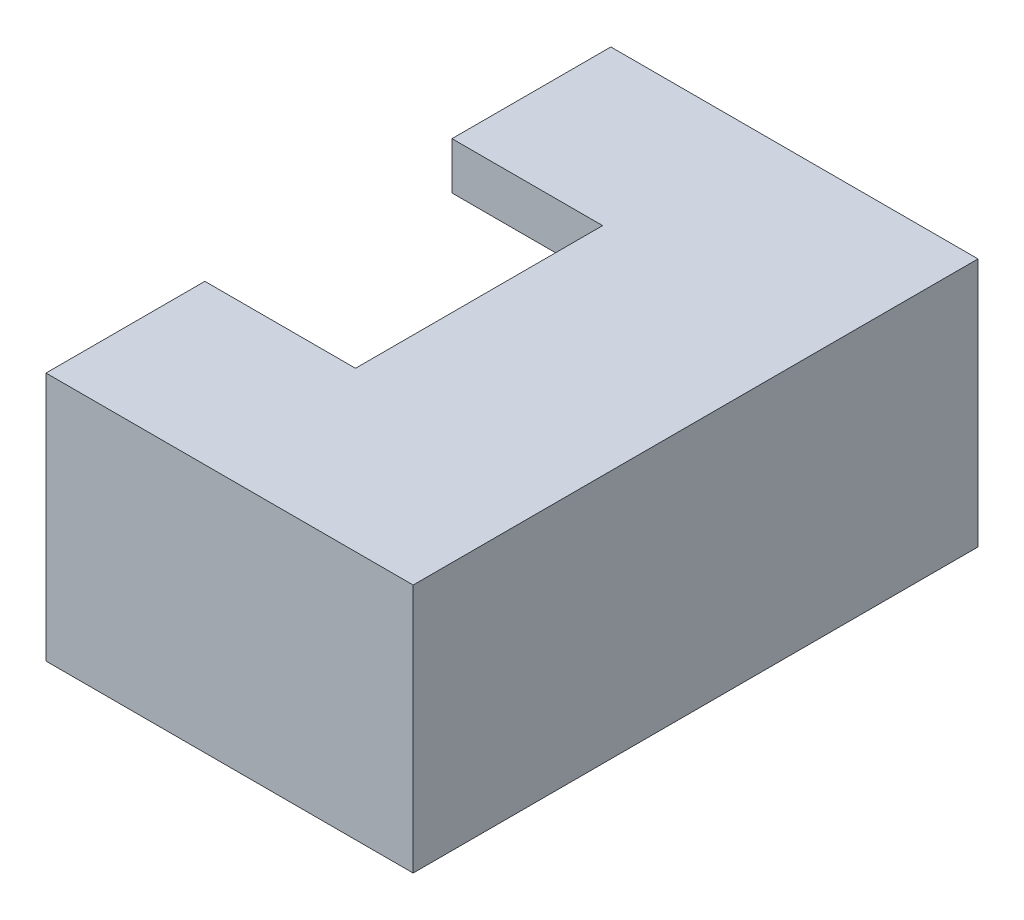
ISO-10303-21;
HEADER;
FILE_DESCRIPTION(('STEP AP214'),'2;1');
FILE_NAME('part.step','',(''),(''),'','','');
FILE_SCHEMA(('AUTOMOTIVE_DESIGN { 1 0 10303 214 1 1 1 1 }'));
ENDSEC;
DATA;
#1=APPLICATION_CONTEXT('core data for automotive mechanical design processes');
#2=APPLICATION_PROTOCOL_DEFINITION('international standard','automotive_design',2000,#1);
#3=PRODUCT_CONTEXT('',#1,'mechanical');
#4=PRODUCT('Part','Part','',(#3));
#5=PRODUCT_RELATED_PRODUCT_CATEGORY('part','',(#4));
#6=PRODUCT_DEFINITION_FORMATION('','',#4);
#7=PRODUCT_DEFINITION_CONTEXT('part definition',#1,'design');
#8=PRODUCT_DEFINITION('design','',#6,#7);
#9=PRODUCT_DEFINITION_SHAPE('','',#8);
#10=(LENGTH_UNIT() NAMED_UNIT(*) SI_UNIT(.MILLI.,.METRE.));
#11=(NAMED_UNIT(*) PLANE_ANGLE_UNIT() SI_UNIT($,.RADIAN.));
#12=(NAMED_UNIT(*) SI_UNIT($,.STERADIAN.) SOLID_ANGLE_UNIT());
#13=UNCERTAINTY_MEASURE_WITH_UNIT(LENGTH_MEASURE(1.E-05),#10,'distance_accuracy_value','');
#14=(GEOMETRIC_REPRESENTATION_CONTEXT(3) GLOBAL_UNCERTAINTY_ASSIGNED_CONTEXT((#13)) GLOBAL_UNIT_ASSIGNED_CONTEXT((#10,
#11,#12)) REPRESENTATION_CONTEXT('',''));
#15=CARTESIAN_POINT('',(0.,0.,0.));
#16=DIRECTION('',(0.,0.,1.));
#17=DIRECTION('',(1.,0.,0.));
#18=AXIS2_PLACEMENT_3D('',#15,#16,#17);
#19=CARTESIAN_POINT('',(7.55,3.4,-3.3));
#20=DIRECTION('',(1.,0.,0.));
#21=DIRECTION('',(0.,0.,-1.));
#22=AXIS2_PLACEMENT_3D('',#19,#20,#21);
#23=PLANE('',#22);
#24=DIRECTION('',(0.,-1.,0.));
#25=VECTOR('',#24,1.);
#26=CARTESIAN_POINT('',(7.55,3.4,-3.6));
#27=LINE('',#26,#25);
#28=CARTESIAN_POINT('',(7.55,3.4,-3.6));
#29=VERTEX_POINT('',#28);
#30=CARTESIAN_POINT('',(7.55,3.1,-3.6));
#31=VERTEX_POINT('',#30);
#32=EDGE_CURVE('P0_E96',#29,#31,#27,.T.);
#33=ORIENTED_EDGE('',*,*,#32,.F.);
#34=DIRECTION('',(0.,0.,-1.));
#35=VECTOR('',#34,1.);
#36=CARTESIAN_POINT('',(7.55,3.4,-3.3));
#37=LINE('',#36,#35);
#38=CARTESIAN_POINT('',(7.55,3.4,-3.3));
#39=VERTEX_POINT('',#38);
#40=EDGE_CURVE('P0_E11',#39,#29,#37,.T.);
#41=ORIENTED_EDGE('',*,*,#40,.F.);
#42=DIRECTION('',(0.,-1.,0.));
#43=VECTOR('',#42,1.);
#44=CARTESIAN_POINT('',(7.55,3.4,-3.3));
#45=LINE('',#44,#43);
#46=CARTESIAN_POINT('',(7.55,3.1,-3.3));
#47=VERTEX_POINT('',#46);
#48=EDGE_CURVE('P0_E90',#39,#47,#45,.T.);
#49=ORIENTED_EDGE('',*,*,#48,.T.);
#50=DIRECTION('',(0.,0.,-1.));
#51=VECTOR('',#50,1.);
#52=CARTESIAN_POINT('',(7.55,3.1,-3.3));
#53=LINE('',#52,#51);
#54=EDGE_CURVE('P0_E35',#47,#31,#53,.T.);
#55=ORIENTED_EDGE('',*,*,#54,.T.);
#56=EDGE_LOOP('',(#33,#41,#49,#55));
#57=FACE_BOUND('',#56,.T.);
#58=ADVANCED_FACE('P0_F32',(#57),#23,.T.);
#59=CARTESIAN_POINT('',(3.55,3.4,-3.3));
#60=DIRECTION('',(0.,1.,0.));
#61=DIRECTION('',(0.,0.,1.));
#62=AXIS2_PLACEMENT_3D('',#59,#60,#61);
#63=PLANE('',#62);
#64=DIRECTION('',(1.,0.,0.));
#65=VECTOR('',#64,1.);
#66=CARTESIAN_POINT('',(3.55,3.4,-3.6));
#67=LINE('',#66,#65);
#68=CARTESIAN_POINT('',(3.55,3.4,-3.6));
#69=VERTEX_POINT('',#68);
#70=EDGE_CURVE('P0_E92',#69,#29,#67,.T.);
#71=ORIENTED_EDGE('',*,*,#70,.F.);
#72=DIRECTION('',(0.,0.,-1.));
#73=VECTOR('',#72,1.);
#74=CARTESIAN_POINT('',(3.55,3.4,-3.3));
#75=LINE('',#74,#73);
#76=CARTESIAN_POINT('',(3.55,3.4,-3.3));
#77=VERTEX_POINT('',#76);
#78=EDGE_CURVE('P0_E41',#77,#69,#75,.T.);
#79=ORIENTED_EDGE('',*,*,#78,.F.);
#80=DIRECTION('',(1.,0.,0.));
#81=VECTOR('',#80,1.);
#82=CARTESIAN_POINT('',(3.55,3.4,-3.3));
#83=LINE('',#82,#81);
#84=EDGE_CURVE('P0_E87',#77,#39,#83,.T.);
#85=ORIENTED_EDGE('',*,*,#84,.T.);
#86=ORIENTED_EDGE('',*,*,#40,.T.);
#87=EDGE_LOOP('',(#71,#79,#85,#86));
#88=FACE_BOUND('',#87,.T.);
#89=ADVANCED_FACE('P0_F106',(#88),#63,.T.);
#90=CARTESIAN_POINT('',(3.55,3.1,-3.3));
#91=DIRECTION('',(-1.,0.,0.));
#92=DIRECTION('',(0.,0.,1.));
#93=AXIS2_PLACEMENT_3D('',#90,#91,#92);
#94=PLANE('',#93);
#95=DIRECTION('',(0.,1.,0.));
#96=VECTOR('',#95,1.);
#97=CARTESIAN_POINT('',(3.55,3.1,-3.6));
#98=LINE('',#97,#96);
#99=CARTESIAN_POINT('',(3.55,3.1,-3.6));
#100=VERTEX_POINT('',#99);
#101=EDGE_CURVE('P0_E82',#100,#69,#98,.T.);
#102=ORIENTED_EDGE('',*,*,#101,.F.);
#103=DIRECTION('',(0.,0.,-1.));
#104=VECTOR('',#103,1.);
#105=CARTESIAN_POINT('',(3.55,3.1,-3.3));
#106=LINE('',#105,#104);
#107=CARTESIAN_POINT('',(3.55,3.1,-3.3));
#108=VERTEX_POINT('',#107);
#109=EDGE_CURVE('P0_E77',#108,#100,#106,.T.);
#110=ORIENTED_EDGE('',*,*,#109,.F.);
#111=DIRECTION('',(0.,1.,0.));
#112=VECTOR('',#111,1.);
#113=CARTESIAN_POINT('',(3.55,3.1,-3.3));
#114=LINE('',#113,#112);
#115=EDGE_CURVE('P0_E80',#108,#77,#114,.T.);
#116=ORIENTED_EDGE('',*,*,#115,.T.);
#117=ORIENTED_EDGE('',*,*,#78,.T.);
#118=EDGE_LOOP('',(#102,#110,#116,#117));
#119=FACE_BOUND('',#118,.T.);
#120=ADVANCED_FACE('P0_F79',(#119),#94,.T.);
#121=CARTESIAN_POINT('',(7.55,3.1,-3.3));
#122=DIRECTION('',(0.,-1.,0.));
#123=DIRECTION('',(0.,0.,-1.));
#124=AXIS2_PLACEMENT_3D('',#121,#122,#123);
#125=PLANE('',#124);
#126=DIRECTION('',(-1.,0.,0.));
#127=VECTOR('',#126,1.);
#128=CARTESIAN_POINT('',(7.55,3.1,-3.6));
#129=LINE('',#128,#127);
#130=EDGE_CURVE('P0_E99',#31,#100,#129,.T.);
#131=ORIENTED_EDGE('',*,*,#130,.F.);
#132=ORIENTED_EDGE('',*,*,#54,.F.);
#133=DIRECTION('',(-1.,0.,0.));
#134=VECTOR('',#133,1.);
#135=CARTESIAN_POINT('',(7.55,3.1,-3.3));
#136=LINE('',#135,#134);
#137=EDGE_CURVE('P0_E86',#47,#108,#136,.T.);
#138=ORIENTED_EDGE('',*,*,#137,.T.);
#139=ORIENTED_EDGE('',*,*,#109,.T.);
#140=EDGE_LOOP('',(#131,#132,#138,#139));
#141=FACE_BOUND('',#140,.T.);
#142=ADVANCED_FACE('P0_F89',(#141),#125,.T.);
#143=CARTESIAN_POINT('',(0.,0.,-3.3));
#144=DIRECTION('',(0.,0.,-1.));
#145=DIRECTION('',(-1.,0.,0.));
#146=AXIS2_PLACEMENT_3D('',#143,#144,#145);
#147=PLANE('',#146);
#148=ORIENTED_EDGE('',*,*,#48,.F.);
#149=ORIENTED_EDGE('',*,*,#84,.F.);
#150=ORIENTED_EDGE('',*,*,#115,.F.);
#151=ORIENTED_EDGE('',*,*,#137,.F.);
#152=EDGE_LOOP('',(#148,#149,#150,#151));
#153=FACE_BOUND('',#152,.T.);
#154=ADVANCED_FACE('P0_F85',(#153),#147,.F.);
#155=CARTESIAN_POINT('',(0.,0.,-3.6));
#156=DIRECTION('',(0.,0.,-1.));
#157=DIRECTION('',(-1.,0.,0.));
#158=AXIS2_PLACEMENT_3D('',#155,#156,#157);
#159=PLANE('',#158);
#160=ORIENTED_EDGE('',*,*,#32,.T.);
#161=ORIENTED_EDGE('',*,*,#130,.T.);
#162=ORIENTED_EDGE('',*,*,#101,.T.);
#163=ORIENTED_EDGE('',*,*,#70,.T.);
#164=EDGE_LOOP('',(#160,#161,#162,#163));
#165=FACE_BOUND('',#164,.T.);
#166=ADVANCED_FACE('P0_F105',(#165),#159,.T.);
#167=CLOSED_SHELL('',(#58,#89,#120,#142,#154,#166));
#168=MANIFOLD_SOLID_BREP('P0_B2',#167);
#169=CARTESIAN_POINT('',(7.55,5.55,-5.5));
#170=DIRECTION('',(0.,1.,0.));
#171=DIRECTION('',(0.,0.,1.));
#172=AXIS2_PLACEMENT_3D('',#169,#170,#171);
#173=PLANE('',#172);
#174=DIRECTION('',(-1.,0.,0.));
#175=VECTOR('',#174,1.);
#176=CARTESIAN_POINT('',(7.55,5.55,-5.5));
#177=LINE('',#176,#175);
#178=CARTESIAN_POINT('',(1.45,5.55,-5.5));
#179=VERTEX_POINT('',#178);
#180=CARTESIAN_POINT('',(7.55,5.55,-5.5));
#181=VERTEX_POINT('',#180);
#182=EDGE_CURVE('P1_E190',#179,#181,#177,.F.);
#183=ORIENTED_EDGE('',*,*,#182,.T.);
#184=DIRECTION('',(0.,0.,-1.));
#185=VECTOR('',#184,1.);
#186=CARTESIAN_POINT('',(7.55,5.55,0.));
#187=LINE('',#186,#185);
#188=CARTESIAN_POINT('',(7.55,5.55,-5.));
#189=VERTEX_POINT('',#188);
#190=EDGE_CURVE('P1_E154',#181,#189,#187,.F.);
#191=ORIENTED_EDGE('',*,*,#190,.T.);
#192=DIRECTION('',(1.,0.,0.));
#193=VECTOR('',#192,1.);
#194=CARTESIAN_POINT('',(7.55,5.55,-5.));
#195=LINE('',#194,#193);
#196=CARTESIAN_POINT('',(1.45,5.55,-5.));
#197=VERTEX_POINT('',#196);
#198=EDGE_CURVE('P1_E169',#189,#197,#195,.F.);
#199=ORIENTED_EDGE('',*,*,#198,.T.);
#200=DIRECTION('',(0.,0.,1.));
#201=VECTOR('',#200,1.);
#202=CARTESIAN_POINT('',(1.45,5.55,-5.5));
#203=LINE('',#202,#201);
#204=EDGE_CURVE('P1_E19',#179,#197,#203,.T.);
#205=ORIENTED_EDGE('',*,*,#204,.F.);
#206=EDGE_LOOP('',(#183,#191,#199,#205));
#207=FACE_BOUND('',#206,.T.);
#208=ADVANCED_FACE('P1_F16',(#207),#173,.F.);
#209=CARTESIAN_POINT('',(7.55,5.55,5.5));
#210=DIRECTION('',(0.,1.,0.));
#211=DIRECTION('',(0.,0.,1.));
#212=AXIS2_PLACEMENT_3D('',#209,#210,#211);
#213=PLANE('',#212);
#214=DIRECTION('',(-1.,0.,0.));
#215=VECTOR('',#214,1.);
#216=CARTESIAN_POINT('',(7.55,5.55,5.));
#217=LINE('',#216,#215);
#218=CARTESIAN_POINT('',(1.45,5.55,5.));
#219=VERTEX_POINT('',#218);
#220=CARTESIAN_POINT('',(7.55,5.55,5.));
#221=VERTEX_POINT('',#220);
#222=EDGE_CURVE('P1_E127',#219,#221,#217,.F.);
#223=ORIENTED_EDGE('',*,*,#222,.T.);
#224=DIRECTION('',(0.,0.,-1.));
#225=VECTOR('',#224,1.);
#226=CARTESIAN_POINT('',(7.55,5.55,0.));
#227=LINE('',#226,#225);
#228=CARTESIAN_POINT('',(7.55,5.55,5.5));
#229=VERTEX_POINT('',#228);
#230=EDGE_CURVE('P1_E162',#221,#229,#227,.F.);
#231=ORIENTED_EDGE('',*,*,#230,.T.);
#232=DIRECTION('',(1.,0.,0.));
#233=VECTOR('',#232,1.);
#234=CARTESIAN_POINT('',(7.55,5.55,5.5));
#235=LINE('',#234,#233);
#236=CARTESIAN_POINT('',(1.45,5.55,5.5));
#237=VERTEX_POINT('',#236);
#238=EDGE_CURVE('P1_E133',#229,#237,#235,.F.);
#239=ORIENTED_EDGE('',*,*,#238,.T.);
#240=DIRECTION('',(0.,0.,1.));
#241=VECTOR('',#240,1.);
#242=CARTESIAN_POINT('',(1.45,5.55,5.5));
#243=LINE('',#242,#241);
#244=EDGE_CURVE('P1_E130',#219,#237,#243,.T.);
#245=ORIENTED_EDGE('',*,*,#244,.F.);
#246=EDGE_LOOP('',(#223,#231,#239,#245));
#247=FACE_BOUND('',#246,.T.);
#248=ADVANCED_FACE('P1_F131',(#247),#213,.F.);
#249=CARTESIAN_POINT('',(7.55,5.55,5.));
#250=DIRECTION('',(0.,0.,-1.));
#251=DIRECTION('',(-1.,0.,0.));
#252=AXIS2_PLACEMENT_3D('',#249,#250,#251);
#253=PLANE('',#252);
#254=DIRECTION('',(1.,0.,0.));
#255=VECTOR('',#254,1.);
#256=CARTESIAN_POINT('',(7.55,5.05,5.));
#257=LINE('',#256,#255);
#258=CARTESIAN_POINT('',(1.45,5.05,5.));
#259=VERTEX_POINT('',#258);
#260=CARTESIAN_POINT('',(7.55,5.05,5.));
#261=VERTEX_POINT('',#260);
#262=EDGE_CURVE('P1_E226',#259,#261,#257,.T.);
#263=ORIENTED_EDGE('',*,*,#262,.T.);
#264=DIRECTION('',(0.,1.,0.));
#265=VECTOR('',#264,1.);
#266=CARTESIAN_POINT('',(7.55,0.,5.));
#267=LINE('',#266,#265);
#268=EDGE_CURVE('P1_E145',#261,#221,#267,.T.);
#269=ORIENTED_EDGE('',*,*,#268,.T.);
#270=ORIENTED_EDGE('',*,*,#222,.F.);
#271=DIRECTION('',(0.,1.,0.));
#272=VECTOR('',#271,1.);
#273=CARTESIAN_POINT('',(1.45,5.55,5.));
#274=LINE('',#273,#272);
#275=EDGE_CURVE('P1_E143',#259,#219,#274,.T.);
#276=ORIENTED_EDGE('',*,*,#275,.F.);
#277=EDGE_LOOP('',(#263,#269,#270,#276));
#278=FACE_BOUND('',#277,.T.);
#279=ADVANCED_FACE('P1_F142',(#278),#253,.F.);
#280=CARTESIAN_POINT('',(7.55,0.,0.));
#281=DIRECTION('',(1.,0.,0.));
#282=DIRECTION('',(0.,0.,-1.));
#283=AXIS2_PLACEMENT_3D('',#280,#281,#282);
#284=PLANE('',#283);
#285=DIRECTION('',(0.,0.,-1.));
#286=VECTOR('',#285,1.);
#287=CARTESIAN_POINT('',(7.55,1.25,-5.5));
#288=LINE('',#287,#286);
#289=CARTESIAN_POINT('',(7.55,1.25,-5.5));
#290=VERTEX_POINT('',#289);
#291=CARTESIAN_POINT('',(7.55,1.25,5.5));
#292=VERTEX_POINT('',#291);
#293=EDGE_CURVE('P1_E201',#290,#292,#288,.F.);
#294=ORIENTED_EDGE('',*,*,#293,.T.);
#295=DIRECTION('',(0.,1.,0.));
#296=VECTOR('',#295,1.);
#297=CARTESIAN_POINT('',(7.55,5.05,5.5));
#298=LINE('',#297,#296);
#299=EDGE_CURVE('P1_E208',#292,#229,#298,.T.);
#300=ORIENTED_EDGE('',*,*,#299,.T.);
#301=ORIENTED_EDGE('',*,*,#230,.F.);
#302=ORIENTED_EDGE('',*,*,#268,.F.);
#303=DIRECTION('',(0.,0.,1.));
#304=VECTOR('',#303,1.);
#305=CARTESIAN_POINT('',(7.55,5.05,-5.));
#306=LINE('',#305,#304);
#307=CARTESIAN_POINT('',(7.55,5.05,-5.));
#308=VERTEX_POINT('',#307);
#309=EDGE_CURVE('P1_E229',#261,#308,#306,.F.);
#310=ORIENTED_EDGE('',*,*,#309,.T.);
#311=DIRECTION('',(0.,1.,0.));
#312=VECTOR('',#311,1.);
#313=CARTESIAN_POINT('',(7.55,5.55,-5.));
#314=LINE('',#313,#312);
#315=EDGE_CURVE('P1_E165',#308,#189,#314,.T.);
#316=ORIENTED_EDGE('',*,*,#315,.T.);
#317=ORIENTED_EDGE('',*,*,#190,.F.);
#318=DIRECTION('',(0.,1.,0.));
#319=VECTOR('',#318,1.);
#320=CARTESIAN_POINT('',(7.55,5.05,-5.5));
#321=LINE('',#320,#319);
#322=EDGE_CURVE('P1_E194',#181,#290,#321,.F.);
#323=ORIENTED_EDGE('',*,*,#322,.T.);
#324=EDGE_LOOP('',(#294,#300,#301,#302,#310,#316,#317,#323));
#325=FACE_BOUND('',#324,.T.);
#326=ADVANCED_FACE('P1_F368',(#325),#284,.F.);
#327=CARTESIAN_POINT('',(7.55,5.55,-5.));
#328=DIRECTION('',(0.,0.,1.));
#329=DIRECTION('',(1.,0.,0.));
#330=AXIS2_PLACEMENT_3D('',#327,#328,#329);
#331=PLANE('',#330);
#332=ORIENTED_EDGE('',*,*,#198,.F.);
#333=ORIENTED_EDGE('',*,*,#315,.F.);
#334=DIRECTION('',(1.,0.,0.));
#335=VECTOR('',#334,1.);
#336=CARTESIAN_POINT('',(7.55,5.05,-5.));
#337=LINE('',#336,#335);
#338=CARTESIAN_POINT('',(1.45,5.05,-5.));
#339=VERTEX_POINT('',#338);
#340=EDGE_CURVE('P1_E233',#308,#339,#337,.F.);
#341=ORIENTED_EDGE('',*,*,#340,.T.);
#342=DIRECTION('',(0.,1.,0.));
#343=VECTOR('',#342,1.);
#344=CARTESIAN_POINT('',(1.45,5.55,-5.));
#345=LINE('',#344,#343);
#346=EDGE_CURVE('P1_E173',#197,#339,#345,.F.);
#347=ORIENTED_EDGE('',*,*,#346,.F.);
#348=EDGE_LOOP('',(#332,#333,#341,#347));
#349=FACE_BOUND('',#348,.T.);
#350=ADVANCED_FACE('P1_F364',(#349),#331,.F.);
#351=CARTESIAN_POINT('',(1.45,1.75,-2.625));
#352=DIRECTION('',(0.,0.,-1.));
#353=DIRECTION('',(-1.,0.,0.));
#354=AXIS2_PLACEMENT_3D('',#351,#352,#353);
#355=PLANE('',#354);
#356=DIRECTION('',(1.,0.,0.));
#357=VECTOR('',#356,1.);
#358=CARTESIAN_POINT('',(7.55,5.05,-2.625));
#359=LINE('',#358,#357);
#360=CARTESIAN_POINT('',(1.45,5.05,-2.625));
#361=VERTEX_POINT('',#360);
#362=CARTESIAN_POINT('',(4.65,5.05,-2.625));
#363=VERTEX_POINT('',#362);
#364=EDGE_CURVE('P1_E214',#361,#363,#359,.T.);
#365=ORIENTED_EDGE('',*,*,#364,.T.);
#366=DIRECTION('',(0.,1.,0.));
#367=VECTOR('',#366,1.);
#368=CARTESIAN_POINT('',(4.65,1.75,-2.625));
#369=LINE('',#368,#367);
#370=CARTESIAN_POINT('',(4.65,6.05,-2.625));
#371=VERTEX_POINT('',#370);
#372=EDGE_CURVE('P1_E179',#363,#371,#369,.T.);
#373=ORIENTED_EDGE('',*,*,#372,.T.);
#374=DIRECTION('',(1.,0.,0.));
#375=VECTOR('',#374,1.);
#376=CARTESIAN_POINT('',(0.,6.05,-2.625));
#377=LINE('',#376,#375);
#378=CARTESIAN_POINT('',(1.45,6.05,-2.625));
#379=VERTEX_POINT('',#378);
#380=EDGE_CURVE('P1_E237',#379,#371,#377,.T.);
#381=ORIENTED_EDGE('',*,*,#380,.F.);
#382=DIRECTION('',(0.,1.,0.));
#383=VECTOR('',#382,1.);
#384=CARTESIAN_POINT('',(1.45,1.75,-2.625));
#385=LINE('',#384,#383);
#386=EDGE_CURVE('P1_E176',#361,#379,#385,.T.);
#387=ORIENTED_EDGE('',*,*,#386,.F.);
#388=EDGE_LOOP('',(#365,#373,#381,#387));
#389=FACE_BOUND('',#388,.T.);
#390=ADVANCED_FACE('P1_F360',(#389),#355,.F.);
#391=CARTESIAN_POINT('',(4.65,1.75,-2.625));
#392=DIRECTION('',(1.,0.,0.));
#393=DIRECTION('',(0.,0.,-1.));
#394=AXIS2_PLACEMENT_3D('',#391,#392,#393);
#395=PLANE('',#394);
#396=DIRECTION('',(0.,0.,1.));
#397=VECTOR('',#396,1.);
#398=CARTESIAN_POINT('',(4.65,5.05,-5.));
#399=LINE('',#398,#397);
#400=CARTESIAN_POINT('',(4.65,5.05,2.625));
#401=VERTEX_POINT('',#400);
#402=EDGE_CURVE('P1_E218',#363,#401,#399,.T.);
#403=ORIENTED_EDGE('',*,*,#402,.T.);
#404=DIRECTION('',(0.,1.,0.));
#405=VECTOR('',#404,1.);
#406=CARTESIAN_POINT('',(4.65,1.75,2.625));
#407=LINE('',#406,#405);
#408=CARTESIAN_POINT('',(4.65,6.05,2.625));
#409=VERTEX_POINT('',#408);
#410=EDGE_CURVE('P1_E186',#401,#409,#407,.T.);
#411=ORIENTED_EDGE('',*,*,#410,.T.);
#412=DIRECTION('',(0.,0.,1.));
#413=VECTOR('',#412,1.);
#414=CARTESIAN_POINT('',(4.65,6.05,0.));
#415=LINE('',#414,#413);
#416=EDGE_CURVE('P1_E240',#371,#409,#415,.T.);
#417=ORIENTED_EDGE('',*,*,#416,.F.);
#418=ORIENTED_EDGE('',*,*,#372,.F.);
#419=EDGE_LOOP('',(#403,#411,#417,#418));
#420=FACE_BOUND('',#419,.T.);
#421=ADVANCED_FACE('P1_F356',(#420),#395,.F.);
#422=CARTESIAN_POINT('',(1.45,1.75,2.625));
#423=DIRECTION('',(0.,0.,1.));
#424=DIRECTION('',(1.,0.,0.));
#425=AXIS2_PLACEMENT_3D('',#422,#423,#424);
#426=PLANE('',#425);
#427=DIRECTION('',(1.,0.,0.));
#428=VECTOR('',#427,1.);
#429=CARTESIAN_POINT('',(7.55,5.05,2.625));
#430=LINE('',#429,#428);
#431=CARTESIAN_POINT('',(1.45,5.05,2.625));
#432=VERTEX_POINT('',#431);
#433=EDGE_CURVE('P1_E222',#401,#432,#430,.F.);
#434=ORIENTED_EDGE('',*,*,#433,.T.);
#435=DIRECTION('',(0.,1.,0.));
#436=VECTOR('',#435,1.);
#437=CARTESIAN_POINT('',(1.45,1.75,2.625));
#438=LINE('',#437,#436);
#439=CARTESIAN_POINT('',(1.45,6.05,2.625));
#440=VERTEX_POINT('',#439);
#441=EDGE_CURVE('P1_E183',#440,#432,#438,.F.);
#442=ORIENTED_EDGE('',*,*,#441,.F.);
#443=DIRECTION('',(1.,0.,0.));
#444=VECTOR('',#443,1.);
#445=CARTESIAN_POINT('',(0.,6.05,2.625));
#446=LINE('',#445,#444);
#447=EDGE_CURVE('P1_E243',#409,#440,#446,.F.);
#448=ORIENTED_EDGE('',*,*,#447,.F.);
#449=ORIENTED_EDGE('',*,*,#410,.F.);
#450=EDGE_LOOP('',(#434,#442,#448,#449));
#451=FACE_BOUND('',#450,.T.);
#452=ADVANCED_FACE('P1_F352',(#451),#426,.F.);
#453=CARTESIAN_POINT('',(7.55,5.05,-5.5));
#454=DIRECTION('',(0.,0.,-1.));
#455=DIRECTION('',(-1.,0.,0.));
#456=AXIS2_PLACEMENT_3D('',#453,#454,#455);
#457=PLANE('',#456);
#458=DIRECTION('',(1.,0.,0.));
#459=VECTOR('',#458,1.);
#460=CARTESIAN_POINT('',(7.55,1.25,-5.5));
#461=LINE('',#460,#459);
#462=CARTESIAN_POINT('',(1.45,1.25,-5.5));
#463=VERTEX_POINT('',#462);
#464=EDGE_CURVE('P1_E197',#463,#290,#461,.T.);
#465=ORIENTED_EDGE('',*,*,#464,.T.);
#466=ORIENTED_EDGE('',*,*,#322,.F.);
#467=ORIENTED_EDGE('',*,*,#182,.F.);
#468=DIRECTION('',(0.,1.,0.));
#469=VECTOR('',#468,1.);
#470=CARTESIAN_POINT('',(1.45,6.05,-5.5));
#471=LINE('',#470,#469);
#472=EDGE_CURVE('P1_E250',#179,#463,#471,.F.);
#473=ORIENTED_EDGE('',*,*,#472,.T.);
#474=EDGE_LOOP('',(#465,#466,#467,#473));
#475=FACE_BOUND('',#474,.T.);
#476=ADVANCED_FACE('P1_F348',(#475),#457,.F.);
#477=CARTESIAN_POINT('',(7.55,1.25,-5.5));
#478=DIRECTION('',(0.,-1.,0.));
#479=DIRECTION('',(0.,0.,-1.));
#480=AXIS2_PLACEMENT_3D('',#477,#478,#479);
#481=PLANE('',#480);
#482=DIRECTION('',(1.,0.,0.));
#483=VECTOR('',#482,1.);
#484=CARTESIAN_POINT('',(7.55,1.25,5.5));
#485=LINE('',#484,#483);
#486=CARTESIAN_POINT('',(1.45,1.25,5.5));
#487=VERTEX_POINT('',#486);
#488=EDGE_CURVE('P1_E204',#487,#292,#485,.T.);
#489=ORIENTED_EDGE('',*,*,#488,.T.);
#490=ORIENTED_EDGE('',*,*,#293,.F.);
#491=ORIENTED_EDGE('',*,*,#464,.F.);
#492=DIRECTION('',(0.,0.,-1.));
#493=VECTOR('',#492,1.);
#494=CARTESIAN_POINT('',(1.45,1.25,-6.));
#495=LINE('',#494,#493);
#496=EDGE_CURVE('P1_E254',#463,#487,#495,.F.);
#497=ORIENTED_EDGE('',*,*,#496,.T.);
#498=EDGE_LOOP('',(#489,#490,#491,#497));
#499=FACE_BOUND('',#498,.T.);
#500=ADVANCED_FACE('P1_F344',(#499),#481,.F.);
#501=CARTESIAN_POINT('',(7.55,5.05,5.5));
#502=DIRECTION('',(0.,0.,1.));
#503=DIRECTION('',(1.,0.,0.));
#504=AXIS2_PLACEMENT_3D('',#501,#502,#503);
#505=PLANE('',#504);
#506=ORIENTED_EDGE('',*,*,#238,.F.);
#507=ORIENTED_EDGE('',*,*,#299,.F.);
#508=ORIENTED_EDGE('',*,*,#488,.F.);
#509=DIRECTION('',(0.,1.,0.));
#510=VECTOR('',#509,1.);
#511=CARTESIAN_POINT('',(1.45,6.05,5.5));
#512=LINE('',#511,#510);
#513=EDGE_CURVE('P1_E258',#487,#237,#512,.T.);
#514=ORIENTED_EDGE('',*,*,#513,.T.);
#515=EDGE_LOOP('',(#506,#507,#508,#514));
#516=FACE_BOUND('',#515,.T.);
#517=ADVANCED_FACE('P1_F340',(#516),#505,.F.);
#518=CARTESIAN_POINT('',(7.55,5.05,-5.));
#519=DIRECTION('',(0.,1.,0.));
#520=DIRECTION('',(0.,0.,1.));
#521=AXIS2_PLACEMENT_3D('',#518,#519,#520);
#522=PLANE('',#521);
#523=ORIENTED_EDGE('',*,*,#340,.F.);
#524=ORIENTED_EDGE('',*,*,#309,.F.);
#525=ORIENTED_EDGE('',*,*,#262,.F.);
#526=DIRECTION('',(0.,0.,-1.));
#527=VECTOR('',#526,1.);
#528=CARTESIAN_POINT('',(1.45,5.05,-6.));
#529=LINE('',#528,#527);
#530=EDGE_CURVE('P1_E152',#259,#432,#529,.T.);
#531=ORIENTED_EDGE('',*,*,#530,.T.);
#532=ORIENTED_EDGE('',*,*,#433,.F.);
#533=ORIENTED_EDGE('',*,*,#402,.F.);
#534=ORIENTED_EDGE('',*,*,#364,.F.);
#535=DIRECTION('',(0.,0.,-1.));
#536=VECTOR('',#535,1.);
#537=CARTESIAN_POINT('',(1.45,5.05,-6.));
#538=LINE('',#537,#536);
#539=EDGE_CURVE('P1_E274',#361,#339,#538,.T.);
#540=ORIENTED_EDGE('',*,*,#539,.T.);
#541=EDGE_LOOP('',(#523,#524,#525,#531,#532,#533,#534,#540));
#542=FACE_BOUND('',#541,.T.);
#543=ADVANCED_FACE('P1_F336',(#542),#522,.F.);
#544=CARTESIAN_POINT('',(0.,6.05,0.));
#545=DIRECTION('',(0.,1.,0.));
#546=DIRECTION('',(0.,0.,1.));
#547=AXIS2_PLACEMENT_3D('',#544,#545,#546);
#548=PLANE('',#547);
#549=DIRECTION('',(1.,0.,0.));
#550=VECTOR('',#549,1.);
#551=CARTESIAN_POINT('',(1.45,6.05,-6.));
#552=LINE('',#551,#550);
#553=CARTESIAN_POINT('',(9.25,6.05,-6.));
#554=VERTEX_POINT('',#553);
#555=CARTESIAN_POINT('',(1.45,6.05,-6.));
#556=VERTEX_POINT('',#555);
#557=EDGE_CURVE('P1_E247',#554,#556,#552,.F.);
#558=ORIENTED_EDGE('',*,*,#557,.T.);
#559=DIRECTION('',(0.,0.,-1.));
#560=VECTOR('',#559,1.);
#561=CARTESIAN_POINT('',(1.45,6.05,-6.));
#562=LINE('',#561,#560);
#563=EDGE_CURVE('P1_E270',#556,#379,#562,.F.);
#564=ORIENTED_EDGE('',*,*,#563,.T.);
#565=ORIENTED_EDGE('',*,*,#380,.T.);
#566=ORIENTED_EDGE('',*,*,#416,.T.);
#567=ORIENTED_EDGE('',*,*,#447,.T.);
#568=DIRECTION('',(0.,0.,-1.));
#569=VECTOR('',#568,1.);
#570=CARTESIAN_POINT('',(1.45,6.05,-6.));
#571=LINE('',#570,#569);
#572=CARTESIAN_POINT('',(1.45,6.05,6.));
#573=VERTEX_POINT('',#572);
#574=EDGE_CURVE('P1_E263',#440,#573,#571,.F.);
#575=ORIENTED_EDGE('',*,*,#574,.T.);
#576=DIRECTION('',(-1.,0.,0.));
#577=VECTOR('',#576,1.);
#578=CARTESIAN_POINT('',(1.45,6.05,6.));
#579=LINE('',#578,#577);
#580=CARTESIAN_POINT('',(9.25,6.05,6.));
#581=VERTEX_POINT('',#580);
#582=EDGE_CURVE('P1_E282',#573,#581,#579,.F.);
#583=ORIENTED_EDGE('',*,*,#582,.T.);
#584=DIRECTION('',(0.,0.,1.));
#585=VECTOR('',#584,1.);
#586=CARTESIAN_POINT('',(9.25,6.05,-6.));
#587=LINE('',#586,#585);
#588=EDGE_CURVE('P1_E287',#581,#554,#587,.F.);
#589=ORIENTED_EDGE('',*,*,#588,.T.);
#590=EDGE_LOOP('',(#558,#564,#565,#566,#567,#575,#583,#589));
#591=FACE_BOUND('',#590,.T.);
#592=ADVANCED_FACE('P1_F333',(#591),#548,.T.);
#593=CARTESIAN_POINT('',(1.45,6.05,-6.));
#594=DIRECTION('',(0.,0.,1.));
#595=DIRECTION('',(1.,0.,0.));
#596=AXIS2_PLACEMENT_3D('',#593,#594,#595);
#597=PLANE('',#596);
#598=DIRECTION('',(0.,1.,0.));
#599=VECTOR('',#598,1.);
#600=CARTESIAN_POINT('',(1.45,6.05,-6.));
#601=LINE('',#600,#599);
#602=CARTESIAN_POINT('',(1.45,0.75,-6.));
#603=VERTEX_POINT('',#602);
#604=EDGE_CURVE('P1_E266',#603,#556,#601,.T.);
#605=ORIENTED_EDGE('',*,*,#604,.T.);
#606=ORIENTED_EDGE('',*,*,#557,.F.);
#607=DIRECTION('',(0.,1.,0.));
#608=VECTOR('',#607,1.);
#609=CARTESIAN_POINT('',(9.25,6.05,-6.));
#610=LINE('',#609,#608);
#611=CARTESIAN_POINT('',(9.25,0.75,-6.));
#612=VERTEX_POINT('',#611);
#613=EDGE_CURVE('P1_E291',#554,#612,#610,.F.);
#614=ORIENTED_EDGE('',*,*,#613,.T.);
#615=DIRECTION('',(1.,0.,0.));
#616=VECTOR('',#615,1.);
#617=CARTESIAN_POINT('',(0.,0.75,-6.));
#618=LINE('',#617,#616);
#619=EDGE_CURVE('P1_E295',#612,#603,#618,.F.);
#620=ORIENTED_EDGE('',*,*,#619,.T.);
#621=EDGE_LOOP('',(#605,#606,#614,#620));
#622=FACE_BOUND('',#621,.T.);
#623=ADVANCED_FACE('P1_F315',(#622),#597,.F.);
#624=CARTESIAN_POINT('',(1.45,6.05,-6.));
#625=DIRECTION('',(1.,0.,0.));
#626=DIRECTION('',(0.,0.,-1.));
#627=AXIS2_PLACEMENT_3D('',#624,#625,#626);
#628=PLANE('',#627);
#629=ORIENTED_EDGE('',*,*,#539,.F.);
#630=ORIENTED_EDGE('',*,*,#386,.T.);
#631=ORIENTED_EDGE('',*,*,#563,.F.);
#632=ORIENTED_EDGE('',*,*,#604,.F.);
#633=DIRECTION('',(0.,0.,1.));
#634=VECTOR('',#633,1.);
#635=CARTESIAN_POINT('',(1.45,0.75,0.));
#636=LINE('',#635,#634);
#637=CARTESIAN_POINT('',(1.45,0.75,6.));
#638=VERTEX_POINT('',#637);
#639=EDGE_CURVE('P1_E299',#603,#638,#636,.T.);
#640=ORIENTED_EDGE('',*,*,#639,.T.);
#641=DIRECTION('',(0.,1.,0.));
#642=VECTOR('',#641,1.);
#643=CARTESIAN_POINT('',(1.45,6.05,6.));
#644=LINE('',#643,#642);
#645=EDGE_CURVE('P1_E278',#638,#573,#644,.T.);
#646=ORIENTED_EDGE('',*,*,#645,.T.);
#647=ORIENTED_EDGE('',*,*,#574,.F.);
#648=ORIENTED_EDGE('',*,*,#441,.T.);
#649=ORIENTED_EDGE('',*,*,#530,.F.);
#650=ORIENTED_EDGE('',*,*,#275,.T.);
#651=ORIENTED_EDGE('',*,*,#244,.T.);
#652=ORIENTED_EDGE('',*,*,#513,.F.);
#653=ORIENTED_EDGE('',*,*,#496,.F.);
#654=ORIENTED_EDGE('',*,*,#472,.F.);
#655=ORIENTED_EDGE('',*,*,#204,.T.);
#656=ORIENTED_EDGE('',*,*,#346,.T.);
#657=EDGE_LOOP('',(#629,#630,#631,#632,#640,#646,#647,#648,#649,#650,#651,#652,#653,#654,#655,#656));
#658=FACE_BOUND('',#657,.T.);
#659=ADVANCED_FACE('P1_F150',(#658),#628,.F.);
#660=CARTESIAN_POINT('',(1.45,6.05,6.));
#661=DIRECTION('',(0.,0.,-1.));
#662=DIRECTION('',(-1.,0.,0.));
#663=AXIS2_PLACEMENT_3D('',#660,#661,#662);
#664=PLANE('',#663);
#665=DIRECTION('',(0.,1.,0.));
#666=VECTOR('',#665,1.);
#667=CARTESIAN_POINT('',(9.25,6.05,6.));
#668=LINE('',#667,#666);
#669=CARTESIAN_POINT('',(9.25,0.75,6.));
#670=VERTEX_POINT('',#669);
#671=EDGE_CURVE('P1_E34',#670,#581,#668,.T.);
#672=ORIENTED_EDGE('',*,*,#671,.T.);
#673=ORIENTED_EDGE('',*,*,#582,.F.);
#674=ORIENTED_EDGE('',*,*,#645,.F.);
#675=DIRECTION('',(1.,0.,0.));
#676=VECTOR('',#675,1.);
#677=CARTESIAN_POINT('',(0.,0.75,6.));
#678=LINE('',#677,#676);
#679=EDGE_CURVE('P1_E26',#638,#670,#678,.T.);
#680=ORIENTED_EDGE('',*,*,#679,.T.);
#681=EDGE_LOOP('',(#672,#673,#674,#680));
#682=FACE_BOUND('',#681,.T.);
#683=ADVANCED_FACE('P1_F307',(#682),#664,.F.);
#684=CARTESIAN_POINT('',(9.25,6.05,-6.));
#685=DIRECTION('',(-1.,0.,0.));
#686=DIRECTION('',(0.,0.,1.));
#687=AXIS2_PLACEMENT_3D('',#684,#685,#686);
#688=PLANE('',#687);
#689=ORIENTED_EDGE('',*,*,#613,.F.);
#690=ORIENTED_EDGE('',*,*,#588,.F.);
#691=ORIENTED_EDGE('',*,*,#671,.F.);
#692=DIRECTION('',(0.,0.,1.));
#693=VECTOR('',#692,1.);
#694=CARTESIAN_POINT('',(9.25,0.75,0.));
#695=LINE('',#694,#693);
#696=EDGE_CURVE('P1_E11',#670,#612,#695,.F.);
#697=ORIENTED_EDGE('',*,*,#696,.T.);
#698=EDGE_LOOP('',(#689,#690,#691,#697));
#699=FACE_BOUND('',#698,.T.);
#700=ADVANCED_FACE('P1_F317',(#699),#688,.F.);
#701=CARTESIAN_POINT('',(0.,0.75,0.));
#702=DIRECTION('',(0.,1.,0.));
#703=DIRECTION('',(0.,0.,1.));
#704=AXIS2_PLACEMENT_3D('',#701,#702,#703);
#705=PLANE('',#704);
#706=ORIENTED_EDGE('',*,*,#679,.F.);
#707=ORIENTED_EDGE('',*,*,#639,.F.);
#708=ORIENTED_EDGE('',*,*,#619,.F.);
#709=ORIENTED_EDGE('',*,*,#696,.F.);
#710=EDGE_LOOP('',(#706,#707,#708,#709));
#711=FACE_BOUND('',#710,.T.);
#712=ADVANCED_FACE('P1_F311',(#711),#705,.F.);
#713=CLOSED_SHELL('',(#208,#248,#279,#326,#350,#390,#421,#452,#476,#500,#517,#543,#592,#623,
#659,#683,#700,#712));
#714=MANIFOLD_SOLID_BREP('P1_B1',#713);
#715=CARTESIAN_POINT('',(3.55000000000001,3.4,3.3));
#716=DIRECTION('',(0.,-1.,0.));
#717=DIRECTION('',(0.,0.,-1.));
#718=AXIS2_PLACEMENT_3D('',#715,#716,#717);
#719=PLANE('',#718);
#720=DIRECTION('',(1.,0.,0.));
#721=VECTOR('',#720,1.);
#722=CARTESIAN_POINT('',(3.55000000000001,3.4,3.3));
#723=LINE('',#722,#721);
#724=CARTESIAN_POINT('',(7.55,3.4,3.3));
#725=VERTEX_POINT('',#724);
#726=CARTESIAN_POINT('',(3.55000000000001,3.4,3.3));
#727=VERTEX_POINT('',#726);
#728=EDGE_CURVE('P2_E64',#725,#727,#723,.F.);
#729=ORIENTED_EDGE('',*,*,#728,.T.);
#730=DIRECTION('',(0.,0.,1.));
#731=VECTOR('',#730,1.);
#732=CARTESIAN_POINT('',(3.55000000000001,3.4,0.));
#733=LINE('',#732,#731);
#734=CARTESIAN_POINT('',(3.55000000000001,3.4,3.6));
#735=VERTEX_POINT('',#734);
#736=EDGE_CURVE('P2_E54',#735,#727,#733,.F.);
#737=ORIENTED_EDGE('',*,*,#736,.F.);
#738=DIRECTION('',(-1.,0.,0.));
#739=VECTOR('',#738,1.);
#740=CARTESIAN_POINT('',(3.55000000000001,3.4,3.6));
#741=LINE('',#740,#739);
#742=CARTESIAN_POINT('',(7.55,3.4,3.6));
#743=VERTEX_POINT('',#742);
#744=EDGE_CURVE('P2_E74',#735,#743,#741,.F.);
#745=ORIENTED_EDGE('',*,*,#744,.T.);
#746=DIRECTION('',(0.,0.,-1.));
#747=VECTOR('',#746,1.);
#748=CARTESIAN_POINT('',(7.55,3.4,3.3));
#749=LINE('',#748,#747);
#750=EDGE_CURVE('P2_E19',#725,#743,#749,.F.);
#751=ORIENTED_EDGE('',*,*,#750,.F.);
#752=EDGE_LOOP('',(#729,#737,#745,#751));
#753=FACE_BOUND('',#752,.T.);
#754=ADVANCED_FACE('P2_F16',(#753),#719,.F.);
#755=CARTESIAN_POINT('',(3.55000000000001,3.4,3.3));
#756=DIRECTION('',(0.,0.,1.));
#757=DIRECTION('',(1.,0.,0.));
#758=AXIS2_PLACEMENT_3D('',#755,#756,#757);
#759=PLANE('',#758);
#760=DIRECTION('',(1.,0.,0.));
#761=VECTOR('',#760,1.);
#762=CARTESIAN_POINT('',(3.55000000000001,3.1,3.3));
#763=LINE('',#762,#761);
#764=CARTESIAN_POINT('',(7.55,3.1,3.3));
#765=VERTEX_POINT('',#764);
#766=CARTESIAN_POINT('',(3.55000000000001,3.1,3.3));
#767=VERTEX_POINT('',#766);
#768=EDGE_CURVE('P2_E72',#765,#767,#763,.F.);
#769=ORIENTED_EDGE('',*,*,#768,.T.);
#770=DIRECTION('',(0.,1.,0.));
#771=VECTOR('',#770,1.);
#772=CARTESIAN_POINT('',(3.55000000000001,0.,3.3));
#773=LINE('',#772,#771);
#774=EDGE_CURVE('P2_E61',#727,#767,#773,.F.);
#775=ORIENTED_EDGE('',*,*,#774,.F.);
#776=ORIENTED_EDGE('',*,*,#728,.F.);
#777=DIRECTION('',(0.,1.,0.));
#778=VECTOR('',#777,1.);
#779=CARTESIAN_POINT('',(7.55,0.,3.3));
#780=LINE('',#779,#778);
#781=EDGE_CURVE('P2_E78',#725,#765,#780,.F.);
#782=ORIENTED_EDGE('',*,*,#781,.T.);
#783=EDGE_LOOP('',(#769,#775,#776,#782));
#784=FACE_BOUND('',#783,.T.);
#785=ADVANCED_FACE('P2_F71',(#784),#759,.F.);
#786=CARTESIAN_POINT('',(3.55000000000001,0.,0.));
#787=DIRECTION('',(-1.,0.,0.));
#788=DIRECTION('',(0.,0.,1.));
#789=AXIS2_PLACEMENT_3D('',#786,#787,#788);
#790=PLANE('',#789);
#791=ORIENTED_EDGE('',*,*,#774,.T.);
#792=DIRECTION('',(0.,0.,1.));
#793=VECTOR('',#792,1.);
#794=CARTESIAN_POINT('',(3.55000000000001,3.1,3.3));
#795=LINE('',#794,#793);
#796=CARTESIAN_POINT('',(3.55000000000001,3.1,3.6));
#797=VERTEX_POINT('',#796);
#798=EDGE_CURVE('P2_E82',#767,#797,#795,.T.);
#799=ORIENTED_EDGE('',*,*,#798,.T.);
#800=DIRECTION('',(0.,1.,0.));
#801=VECTOR('',#800,1.);
#802=CARTESIAN_POINT('',(3.55000000000001,3.4,3.6));
#803=LINE('',#802,#801);
#804=EDGE_CURVE('P2_E63',#797,#735,#803,.T.);
#805=ORIENTED_EDGE('',*,*,#804,.T.);
#806=ORIENTED_EDGE('',*,*,#736,.T.);
#807=EDGE_LOOP('',(#791,#799,#805,#806));
#808=FACE_BOUND('',#807,.T.);
#809=ADVANCED_FACE('P2_F58',(#808),#790,.T.);
#810=CARTESIAN_POINT('',(3.55000000000001,3.4,3.6));
#811=DIRECTION('',(0.,0.,-1.));
#812=DIRECTION('',(-1.,0.,0.));
#813=AXIS2_PLACEMENT_3D('',#810,#811,#812);
#814=PLANE('',#813);
#815=ORIENTED_EDGE('',*,*,#744,.F.);
#816=ORIENTED_EDGE('',*,*,#804,.F.);
#817=DIRECTION('',(1.,0.,0.));
#818=VECTOR('',#817,1.);
#819=CARTESIAN_POINT('',(3.55000000000001,3.1,3.6));
#820=LINE('',#819,#818);
#821=CARTESIAN_POINT('',(7.55,3.1,3.6));
#822=VERTEX_POINT('',#821);
#823=EDGE_CURVE('P2_E25',#797,#822,#820,.T.);
#824=ORIENTED_EDGE('',*,*,#823,.T.);
#825=DIRECTION('',(0.,1.,0.));
#826=VECTOR('',#825,1.);
#827=CARTESIAN_POINT('',(7.55,0.,3.6));
#828=LINE('',#827,#826);
#829=EDGE_CURVE('P2_E33',#822,#743,#828,.T.);
#830=ORIENTED_EDGE('',*,*,#829,.T.);
#831=EDGE_LOOP('',(#815,#816,#824,#830));
#832=FACE_BOUND('',#831,.T.);
#833=ADVANCED_FACE('P2_F87',(#832),#814,.F.);
#834=CARTESIAN_POINT('',(7.55,0.,0.));
#835=DIRECTION('',(-1.,0.,0.));
#836=DIRECTION('',(0.,0.,1.));
#837=AXIS2_PLACEMENT_3D('',#834,#835,#836);
#838=PLANE('',#837);
#839=DIRECTION('',(0.,0.,1.));
#840=VECTOR('',#839,1.);
#841=CARTESIAN_POINT('',(7.55,3.1,3.3));
#842=LINE('',#841,#840);
#843=EDGE_CURVE('P2_E11',#822,#765,#842,.F.);
#844=ORIENTED_EDGE('',*,*,#843,.T.);
#845=ORIENTED_EDGE('',*,*,#781,.F.);
#846=ORIENTED_EDGE('',*,*,#750,.T.);
#847=ORIENTED_EDGE('',*,*,#829,.F.);
#848=EDGE_LOOP('',(#844,#845,#846,#847));
#849=FACE_BOUND('',#848,.T.);
#850=ADVANCED_FACE('P2_F90',(#849),#838,.F.);
#851=CARTESIAN_POINT('',(3.55000000000001,3.1,3.3));
#852=DIRECTION('',(0.,1.,0.));
#853=DIRECTION('',(0.,0.,1.));
#854=AXIS2_PLACEMENT_3D('',#851,#852,#853);
#855=PLANE('',#854);
#856=ORIENTED_EDGE('',*,*,#823,.F.);
#857=ORIENTED_EDGE('',*,*,#798,.F.);
#858=ORIENTED_EDGE('',*,*,#768,.F.);
#859=ORIENTED_EDGE('',*,*,#843,.F.);
#860=EDGE_LOOP('',(#856,#857,#858,#859));
#861=FACE_BOUND('',#860,.T.);
#862=ADVANCED_FACE('P2_F89',(#861),#855,.F.);
#863=CLOSED_SHELL('',(#754,#785,#809,#833,#850,#862));
#864=MANIFOLD_SOLID_BREP('P2_B1',#863);
#865=CARTESIAN_POINT('',(3.55,3.4,1.));
#866=DIRECTION('',(0.,-1.,0.));
#867=DIRECTION('',(0.,0.,-1.));
#868=AXIS2_PLACEMENT_3D('',#865,#866,#867);
#869=PLANE('',#868);
#870=DIRECTION('',(1.,0.,0.));
#871=VECTOR('',#870,1.);
#872=CARTESIAN_POINT('',(3.55,3.4,1.));
#873=LINE('',#872,#871);
#874=CARTESIAN_POINT('',(7.55,3.4,1.));
#875=VERTEX_POINT('',#874);
#876=CARTESIAN_POINT('',(3.55,3.4,1.));
#877=VERTEX_POINT('',#876);
#878=EDGE_CURVE('P3_E64',#875,#877,#873,.F.);
#879=ORIENTED_EDGE('',*,*,#878,.T.);
#880=DIRECTION('',(0.,0.,1.));
#881=VECTOR('',#880,1.);
#882=CARTESIAN_POINT('',(3.55,3.4,0.));
#883=LINE('',#882,#881);
#884=CARTESIAN_POINT('',(3.55,3.4,1.3));
#885=VERTEX_POINT('',#884);
#886=EDGE_CURVE('P3_E54',#885,#877,#883,.F.);
#887=ORIENTED_EDGE('',*,*,#886,.F.);
#888=DIRECTION('',(-1.,0.,0.));
#889=VECTOR('',#888,1.);
#890=CARTESIAN_POINT('',(3.55,3.4,1.3));
#891=LINE('',#890,#889);
#892=CARTESIAN_POINT('',(7.55,3.4,1.3));
#893=VERTEX_POINT('',#892);
#894=EDGE_CURVE('P3_E74',#885,#893,#891,.F.);
#895=ORIENTED_EDGE('',*,*,#894,.T.);
#896=DIRECTION('',(0.,0.,-1.));
#897=VECTOR('',#896,1.);
#898=CARTESIAN_POINT('',(7.55,3.4,1.));
#899=LINE('',#898,#897);
#900=EDGE_CURVE('P3_E19',#875,#893,#899,.F.);
#901=ORIENTED_EDGE('',*,*,#900,.F.);
#902=EDGE_LOOP('',(#879,#887,#895,#901));
#903=FACE_BOUND('',#902,.T.);
#904=ADVANCED_FACE('P3_F16',(#903),#869,.F.);
#905=CARTESIAN_POINT('',(3.55,3.4,1.));
#906=DIRECTION('',(0.,0.,1.));
#907=DIRECTION('',(1.,0.,0.));
#908=AXIS2_PLACEMENT_3D('',#905,#906,#907);
#909=PLANE('',#908);
#910=DIRECTION('',(1.,0.,0.));
#911=VECTOR('',#910,1.);
#912=CARTESIAN_POINT('',(3.55,3.1,0.999999999999999));
#913=LINE('',#912,#911);
#914=CARTESIAN_POINT('',(7.55,3.1,0.999999999999999));
#915=VERTEX_POINT('',#914);
#916=CARTESIAN_POINT('',(3.55,3.1,1.));
#917=VERTEX_POINT('',#916);
#918=EDGE_CURVE('P3_E72',#915,#917,#913,.F.);
#919=ORIENTED_EDGE('',*,*,#918,.T.);
#920=DIRECTION('',(0.,1.,0.));
#921=VECTOR('',#920,1.);
#922=CARTESIAN_POINT('',(3.55,0.,1.));
#923=LINE('',#922,#921);
#924=EDGE_CURVE('P3_E61',#877,#917,#923,.F.);
#925=ORIENTED_EDGE('',*,*,#924,.F.);
#926=ORIENTED_EDGE('',*,*,#878,.F.);
#927=DIRECTION('',(0.,1.,0.));
#928=VECTOR('',#927,1.);
#929=CARTESIAN_POINT('',(7.55,0.,0.999999999999999));
#930=LINE('',#929,#928);
#931=EDGE_CURVE('P3_E78',#875,#915,#930,.F.);
#932=ORIENTED_EDGE('',*,*,#931,.T.);
#933=EDGE_LOOP('',(#919,#925,#926,#932));
#934=FACE_BOUND('',#933,.T.);
#935=ADVANCED_FACE('P3_F71',(#934),#909,.F.);
#936=CARTESIAN_POINT('',(3.55,0.,0.));
#937=DIRECTION('',(-1.,0.,0.));
#938=DIRECTION('',(0.,0.,1.));
#939=AXIS2_PLACEMENT_3D('',#936,#937,#938);
#940=PLANE('',#939);
#941=ORIENTED_EDGE('',*,*,#924,.T.);
#942=DIRECTION('',(0.,0.,1.));
#943=VECTOR('',#942,1.);
#944=CARTESIAN_POINT('',(3.55,3.1,1.));
#945=LINE('',#944,#943);
#946=CARTESIAN_POINT('',(3.55,3.1,1.3));
#947=VERTEX_POINT('',#946);
#948=EDGE_CURVE('P3_E82',#917,#947,#945,.T.);
#949=ORIENTED_EDGE('',*,*,#948,.T.);
#950=DIRECTION('',(0.,1.,0.));
#951=VECTOR('',#950,1.);
#952=CARTESIAN_POINT('',(3.55,3.4,1.3));
#953=LINE('',#952,#951);
#954=EDGE_CURVE('P3_E63',#947,#885,#953,.T.);
#955=ORIENTED_EDGE('',*,*,#954,.T.);
#956=ORIENTED_EDGE('',*,*,#886,.T.);
#957=EDGE_LOOP('',(#941,#949,#955,#956));
#958=FACE_BOUND('',#957,.T.);
#959=ADVANCED_FACE('P3_F58',(#958),#940,.T.);
#960=CARTESIAN_POINT('',(3.55,3.4,1.3));
#961=DIRECTION('',(0.,0.,-1.));
#962=DIRECTION('',(-1.,0.,0.));
#963=AXIS2_PLACEMENT_3D('',#960,#961,#962);
#964=PLANE('',#963);
#965=ORIENTED_EDGE('',*,*,#894,.F.);
#966=ORIENTED_EDGE('',*,*,#954,.F.);
#967=DIRECTION('',(1.,0.,0.));
#968=VECTOR('',#967,1.);
#969=CARTESIAN_POINT('',(3.55,3.1,1.3));
#970=LINE('',#969,#968);
#971=CARTESIAN_POINT('',(7.55,3.1,1.3));
#972=VERTEX_POINT('',#971);
#973=EDGE_CURVE('P3_E25',#947,#972,#970,.T.);
#974=ORIENTED_EDGE('',*,*,#973,.T.);
#975=DIRECTION('',(0.,1.,0.));
#976=VECTOR('',#975,1.);
#977=CARTESIAN_POINT('',(7.55,0.,1.3));
#978=LINE('',#977,#976);
#979=EDGE_CURVE('P3_E33',#972,#893,#978,.T.);
#980=ORIENTED_EDGE('',*,*,#979,.T.);
#981=EDGE_LOOP('',(#965,#966,#974,#980));
#982=FACE_BOUND('',#981,.T.);
#983=ADVANCED_FACE('P3_F87',(#982),#964,.F.);
#984=CARTESIAN_POINT('',(7.55,0.,0.));
#985=DIRECTION('',(-1.,0.,0.));
#986=DIRECTION('',(0.,0.,1.));
#987=AXIS2_PLACEMENT_3D('',#984,#985,#986);
#988=PLANE('',#987);
#989=DIRECTION('',(0.,0.,1.));
#990=VECTOR('',#989,1.);
#991=CARTESIAN_POINT('',(7.55,3.1,1.));
#992=LINE('',#991,#990);
#993=EDGE_CURVE('P3_E11',#972,#915,#992,.F.);
#994=ORIENTED_EDGE('',*,*,#993,.T.);
#995=ORIENTED_EDGE('',*,*,#931,.F.);
#996=ORIENTED_EDGE('',*,*,#900,.T.);
#997=ORIENTED_EDGE('',*,*,#979,.F.);
#998=EDGE_LOOP('',(#994,#995,#996,#997));
#999=FACE_BOUND('',#998,.T.);
#1000=ADVANCED_FACE('P3_F90',(#999),#988,.F.);
#1001=CARTESIAN_POINT('',(3.55,3.1,1.));
#1002=DIRECTION('',(0.,1.,0.));
#1003=DIRECTION('',(0.,0.,1.));
#1004=AXIS2_PLACEMENT_3D('',#1001,#1002,#1003);
#1005=PLANE('',#1004);
#1006=ORIENTED_EDGE('',*,*,#973,.F.);
#1007=ORIENTED_EDGE('',*,*,#948,.F.);
#1008=ORIENTED_EDGE('',*,*,#918,.F.);
#1009=ORIENTED_EDGE('',*,*,#993,.F.);
#1010=EDGE_LOOP('',(#1006,#1007,#1008,#1009));
#1011=FACE_BOUND('',#1010,.T.);
#1012=ADVANCED_FACE('P3_F89',(#1011),#1005,.F.);
#1013=CLOSED_SHELL('',(#904,#935,#959,#983,#1000,#1012));
#1014=MANIFOLD_SOLID_BREP('P3_B1',#1013);
#1015=CARTESIAN_POINT('',(3.55,3.4,-1.3));
#1016=DIRECTION('',(0.,-1.,0.));
#1017=DIRECTION('',(0.,0.,-1.));
#1018=AXIS2_PLACEMENT_3D('',#1015,#1016,#1017);
#1019=PLANE('',#1018);
#1020=DIRECTION('',(1.,0.,0.));
#1021=VECTOR('',#1020,1.);
#1022=CARTESIAN_POINT('',(3.55,3.4,-1.3));
#1023=LINE('',#1022,#1021);
#1024=CARTESIAN_POINT('',(7.55,3.4,-1.3));
#1025=VERTEX_POINT('',#1024);
#1026=CARTESIAN_POINT('',(3.55,3.4,-1.3));
#1027=VERTEX_POINT('',#1026);
#1028=EDGE_CURVE('P4_E64',#1025,#1027,#1023,.F.);
#1029=ORIENTED_EDGE('',*,*,#1028,.T.);
#1030=DIRECTION('',(0.,0.,1.));
#1031=VECTOR('',#1030,1.);
#1032=CARTESIAN_POINT('',(3.55000000000001,3.4,0.));
#1033=LINE('',#1032,#1031);
#1034=CARTESIAN_POINT('',(3.55,3.4,-0.999999999999999));
#1035=VERTEX_POINT('',#1034);
#1036=EDGE_CURVE('P4_E54',#1035,#1027,#1033,.F.);
#1037=ORIENTED_EDGE('',*,*,#1036,.F.);
#1038=DIRECTION('',(-1.,0.,0.));
#1039=VECTOR('',#1038,1.);
#1040=CARTESIAN_POINT('',(3.55,3.4,-0.999999999999999));
#1041=LINE('',#1040,#1039);
#1042=CARTESIAN_POINT('',(7.55,3.4,-1.));
#1043=VERTEX_POINT('',#1042);
#1044=EDGE_CURVE('P4_E74',#1035,#1043,#1041,.F.);
#1045=ORIENTED_EDGE('',*,*,#1044,.T.);
#1046=DIRECTION('',(0.,0.,-1.));
#1047=VECTOR('',#1046,1.);
#1048=CARTESIAN_POINT('',(7.55,3.4,-1.3));
#1049=LINE('',#1048,#1047);
#1050=EDGE_CURVE('P4_E19',#1025,#1043,#1049,.F.);
#1051=ORIENTED_EDGE('',*,*,#1050,.F.);
#1052=EDGE_LOOP('',(#1029,#1037,#1045,#1051));
#1053=FACE_BOUND('',#1052,.T.);
#1054=ADVANCED_FACE('P4_F16',(#1053),#1019,.F.);
#1055=CARTESIAN_POINT('',(3.55,3.4,-1.3));
#1056=DIRECTION('',(0.,0.,1.));
#1057=DIRECTION('',(1.,0.,0.));
#1058=AXIS2_PLACEMENT_3D('',#1055,#1056,#1057);
#1059=PLANE('',#1058);
#1060=DIRECTION('',(1.,0.,0.));
#1061=VECTOR('',#1060,1.);
#1062=CARTESIAN_POINT('',(3.55,3.1,-1.3));
#1063=LINE('',#1062,#1061);
#1064=CARTESIAN_POINT('',(7.55,3.1,-1.3));
#1065=VERTEX_POINT('',#1064);
#1066=CARTESIAN_POINT('',(3.55,3.1,-1.3));
#1067=VERTEX_POINT('',#1066);
#1068=EDGE_CURVE('P4_E72',#1065,#1067,#1063,.F.);
#1069=ORIENTED_EDGE('',*,*,#1068,.T.);
#1070=DIRECTION('',(0.,1.,0.));
#1071=VECTOR('',#1070,1.);
#1072=CARTESIAN_POINT('',(3.55,0.,-1.3));
#1073=LINE('',#1072,#1071);
#1074=EDGE_CURVE('P4_E61',#1027,#1067,#1073,.F.);
#1075=ORIENTED_EDGE('',*,*,#1074,.F.);
#1076=ORIENTED_EDGE('',*,*,#1028,.F.);
#1077=DIRECTION('',(0.,1.,0.));
#1078=VECTOR('',#1077,1.);
#1079=CARTESIAN_POINT('',(7.55,0.,-1.3));
#1080=LINE('',#1079,#1078);
#1081=EDGE_CURVE('P4_E78',#1025,#1065,#1080,.F.);
#1082=ORIENTED_EDGE('',*,*,#1081,.T.);
#1083=EDGE_LOOP('',(#1069,#1075,#1076,#1082));
#1084=FACE_BOUND('',#1083,.T.);
#1085=ADVANCED_FACE('P4_F71',(#1084),#1059,.F.);
#1086=CARTESIAN_POINT('',(3.55000000000001,0.,0.));
#1087=DIRECTION('',(-1.,0.,0.));
#1088=DIRECTION('',(0.,0.,1.));
#1089=AXIS2_PLACEMENT_3D('',#1086,#1087,#1088);
#1090=PLANE('',#1089);
#1091=ORIENTED_EDGE('',*,*,#1074,.T.);
#1092=DIRECTION('',(0.,0.,1.));
#1093=VECTOR('',#1092,1.);
#1094=CARTESIAN_POINT('',(3.55,3.1,-1.3));
#1095=LINE('',#1094,#1093);
#1096=CARTESIAN_POINT('',(3.55,3.1,-0.999999999999999));
#1097=VERTEX_POINT('',#1096);
#1098=EDGE_CURVE('P4_E82',#1067,#1097,#1095,.T.);
#1099=ORIENTED_EDGE('',*,*,#1098,.T.);
#1100=DIRECTION('',(0.,1.,0.));
#1101=VECTOR('',#1100,1.);
#1102=CARTESIAN_POINT('',(3.55,3.4,-0.999999999999999));
#1103=LINE('',#1102,#1101);
#1104=EDGE_CURVE('P4_E63',#1097,#1035,#1103,.T.);
#1105=ORIENTED_EDGE('',*,*,#1104,.T.);
#1106=ORIENTED_EDGE('',*,*,#1036,.T.);
#1107=EDGE_LOOP('',(#1091,#1099,#1105,#1106));
#1108=FACE_BOUND('',#1107,.T.);
#1109=ADVANCED_FACE('P4_F58',(#1108),#1090,.T.);
#1110=CARTESIAN_POINT('',(3.55,3.4,-0.999999999999999));
#1111=DIRECTION('',(0.,0.,-1.));
#1112=DIRECTION('',(-1.,0.,0.));
#1113=AXIS2_PLACEMENT_3D('',#1110,#1111,#1112);
#1114=PLANE('',#1113);
#1115=ORIENTED_EDGE('',*,*,#1044,.F.);
#1116=ORIENTED_EDGE('',*,*,#1104,.F.);
#1117=DIRECTION('',(1.,0.,0.));
#1118=VECTOR('',#1117,1.);
#1119=CARTESIAN_POINT('',(3.55,3.1,-0.999999999999999));
#1120=LINE('',#1119,#1118);
#1121=CARTESIAN_POINT('',(7.55,3.1,-1.));
#1122=VERTEX_POINT('',#1121);
#1123=EDGE_CURVE('P4_E25',#1097,#1122,#1120,.T.);
#1124=ORIENTED_EDGE('',*,*,#1123,.T.);
#1125=DIRECTION('',(0.,1.,0.));
#1126=VECTOR('',#1125,1.);
#1127=CARTESIAN_POINT('',(7.55,0.,-1.));
#1128=LINE('',#1127,#1126);
#1129=EDGE_CURVE('P4_E33',#1122,#1043,#1128,.T.);
#1130=ORIENTED_EDGE('',*,*,#1129,.T.);
#1131=EDGE_LOOP('',(#1115,#1116,#1124,#1130));
#1132=FACE_BOUND('',#1131,.T.);
#1133=ADVANCED_FACE('P4_F87',(#1132),#1114,.F.);
#1134=CARTESIAN_POINT('',(7.55000000000001,0.,0.));
#1135=DIRECTION('',(-1.,0.,0.));
#1136=DIRECTION('',(0.,0.,1.));
#1137=AXIS2_PLACEMENT_3D('',#1134,#1135,#1136);
#1138=PLANE('',#1137);
#1139=DIRECTION('',(0.,0.,1.));
#1140=VECTOR('',#1139,1.);
#1141=CARTESIAN_POINT('',(7.55,3.1,-1.3));
#1142=LINE('',#1141,#1140);
#1143=EDGE_CURVE('P4_E11',#1122,#1065,#1142,.F.);
#1144=ORIENTED_EDGE('',*,*,#1143,.T.);
#1145=ORIENTED_EDGE('',*,*,#1081,.F.);
#1146=ORIENTED_EDGE('',*,*,#1050,.T.);
#1147=ORIENTED_EDGE('',*,*,#1129,.F.);
#1148=EDGE_LOOP('',(#1144,#1145,#1146,#1147));
#1149=FACE_BOUND('',#1148,.T.);
#1150=ADVANCED_FACE('P4_F90',(#1149),#1138,.F.);
#1151=CARTESIAN_POINT('',(3.55,3.1,-1.3));
#1152=DIRECTION('',(0.,1.,0.));
#1153=DIRECTION('',(0.,0.,1.));
#1154=AXIS2_PLACEMENT_3D('',#1151,#1152,#1153);
#1155=PLANE('',#1154);
#1156=ORIENTED_EDGE('',*,*,#1123,.F.);
#1157=ORIENTED_EDGE('',*,*,#1098,.F.);
#1158=ORIENTED_EDGE('',*,*,#1068,.F.);
#1159=ORIENTED_EDGE('',*,*,#1143,.F.);
#1160=EDGE_LOOP('',(#1156,#1157,#1158,#1159));
#1161=FACE_BOUND('',#1160,.T.);
#1162=ADVANCED_FACE('P4_F89',(#1161),#1155,.F.);
#1163=CLOSED_SHELL('',(#1054,#1085,#1109,#1133,#1150,#1162));
#1164=MANIFOLD_SOLID_BREP('P4_B1',#1163);
#1165=ADVANCED_BREP_SHAPE_REPRESENTATION('',(#18,#168,#714,#864,#1014,#1164),#14);
#1166=SHAPE_DEFINITION_REPRESENTATION(#9,#1165);
ENDSEC;
END-ISO-10303-21;
